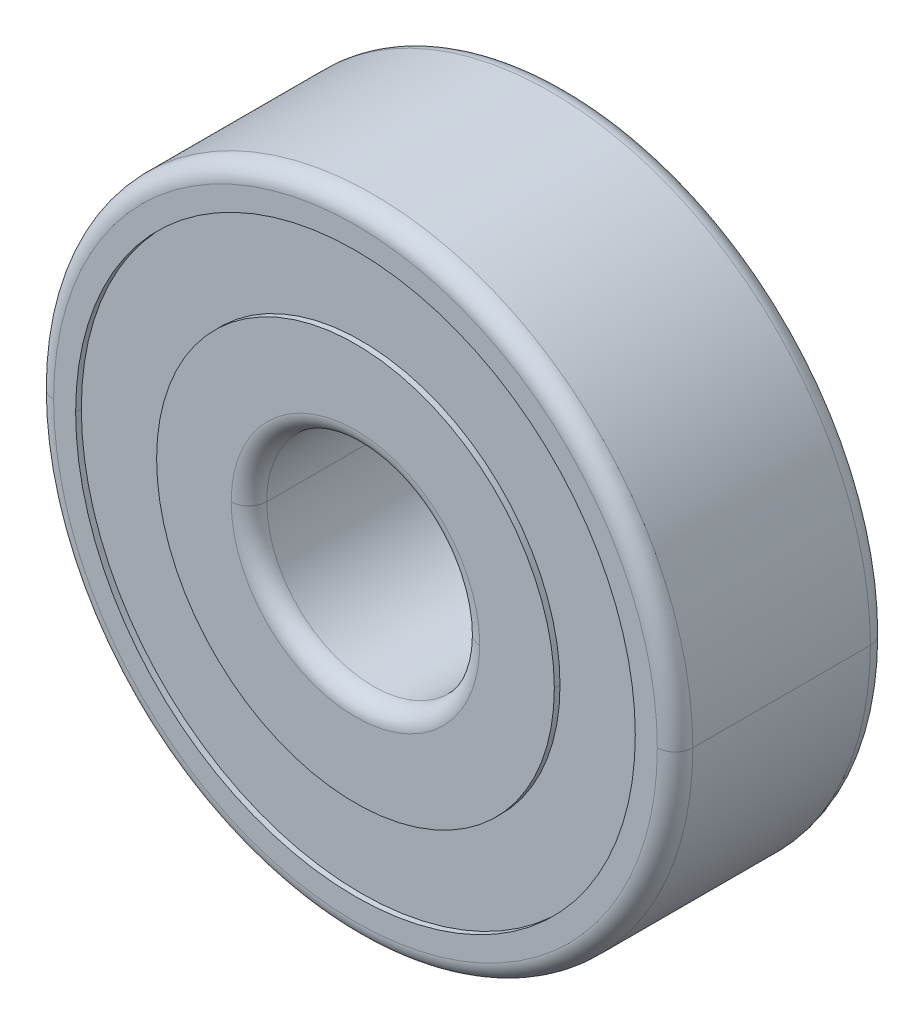
ISO-10303-21;
HEADER;
FILE_DESCRIPTION(('STEP AP214'),'2;1');
FILE_NAME('part.step','',(''),(''),'','','');
FILE_SCHEMA(('AUTOMOTIVE_DESIGN { 1 0 10303 214 1 1 1 1 }'));
ENDSEC;
DATA;
#1=APPLICATION_CONTEXT('core data for automotive mechanical design processes');
#2=APPLICATION_PROTOCOL_DEFINITION('international standard','automotive_design',2000,#1);
#3=PRODUCT_CONTEXT('',#1,'mechanical');
#4=PRODUCT('Part','Part','',(#3));
#5=PRODUCT_RELATED_PRODUCT_CATEGORY('part','',(#4));
#6=PRODUCT_DEFINITION_FORMATION('','',#4);
#7=PRODUCT_DEFINITION_CONTEXT('part definition',#1,'design');
#8=PRODUCT_DEFINITION('design','',#6,#7);
#9=PRODUCT_DEFINITION_SHAPE('','',#8);
#10=(LENGTH_UNIT() NAMED_UNIT(*) SI_UNIT(.MILLI.,.METRE.));
#11=(NAMED_UNIT(*) PLANE_ANGLE_UNIT() SI_UNIT($,.RADIAN.));
#12=(NAMED_UNIT(*) SI_UNIT($,.STERADIAN.) SOLID_ANGLE_UNIT());
#13=UNCERTAINTY_MEASURE_WITH_UNIT(LENGTH_MEASURE(1.E-05),#10,'distance_accuracy_value','');
#14=(GEOMETRIC_REPRESENTATION_CONTEXT(3) GLOBAL_UNCERTAINTY_ASSIGNED_CONTEXT((#13)) GLOBAL_UNIT_ASSIGNED_CONTEXT((#10,
#11,#12)) REPRESENTATION_CONTEXT('',''));
#15=CARTESIAN_POINT('',(0.,0.,0.));
#16=DIRECTION('',(0.,0.,1.));
#17=DIRECTION('',(1.,0.,0.));
#18=AXIS2_PLACEMENT_3D('',#15,#16,#17);
#19=CARTESIAN_POINT('',(0.,0.,-4.5085));
#20=DIRECTION('',(0.,0.,-1.));
#21=DIRECTION('',(-1.,0.,0.));
#22=AXIS2_PLACEMENT_3D('',#19,#20,#21);
#23=CYLINDRICAL_SURFACE('',#22,8.89);
#24=DIRECTION('',(0.,0.,-1.));
#25=VECTOR('',#24,1.);
#26=CARTESIAN_POINT('',(8.89,0.,-4.5085));
#27=LINE('',#26,#25);
#28=CARTESIAN_POINT('',(8.89,0.,-4.5085));
#29=VERTEX_POINT('',#28);
#30=CARTESIAN_POINT('',(8.89,0.,-4.7625));
#31=VERTEX_POINT('',#30);
#32=EDGE_CURVE('E387',#29,#31,#27,.T.);
#33=ORIENTED_EDGE('',*,*,#32,.F.);
#34=CARTESIAN_POINT('',(0.,0.,-4.5085));
#35=DIRECTION('',(0.,0.,1.));
#36=DIRECTION('',(1.,0.,0.));
#37=AXIS2_PLACEMENT_3D('',#34,#35,#36);
#38=CIRCLE('',#37,8.89);
#39=CARTESIAN_POINT('',(-8.89,0.,-4.5085));
#40=VERTEX_POINT('',#39);
#41=EDGE_CURVE('E11',#40,#29,#38,.T.);
#42=ORIENTED_EDGE('',*,*,#41,.F.);
#43=DIRECTION('',(0.,0.,-1.));
#44=VECTOR('',#43,1.);
#45=CARTESIAN_POINT('',(-8.89,0.,-4.5085));
#46=LINE('',#45,#44);
#47=CARTESIAN_POINT('',(-8.89,0.,-4.7625));
#48=VERTEX_POINT('',#47);
#49=EDGE_CURVE('E349',#40,#48,#46,.T.);
#50=ORIENTED_EDGE('',*,*,#49,.T.);
#51=CARTESIAN_POINT('',(0.,0.,-4.7625));
#52=DIRECTION('',(0.,0.,1.));
#53=DIRECTION('',(1.,0.,0.));
#54=AXIS2_PLACEMENT_3D('',#51,#52,#53);
#55=CIRCLE('',#54,8.89);
#56=EDGE_CURVE('E304',#48,#31,#55,.T.);
#57=ORIENTED_EDGE('',*,*,#56,.T.);
#58=EDGE_LOOP('',(#33,#42,#50,#57));
#59=FACE_BOUND('',#58,.T.);
#60=ADVANCED_FACE('F16',(#59),#23,.T.);
#61=CARTESIAN_POINT('',(0.,0.,-4.5085));
#62=DIRECTION('',(0.,0.,-1.));
#63=DIRECTION('',(-1.,0.,0.));
#64=AXIS2_PLACEMENT_3D('',#61,#62,#63);
#65=CYLINDRICAL_SURFACE('',#64,12.5095);
#66=DIRECTION('',(0.,0.,-1.));
#67=VECTOR('',#66,1.);
#68=CARTESIAN_POINT('',(12.5095,0.,-4.5085));
#69=LINE('',#68,#67);
#70=CARTESIAN_POINT('',(12.5095,0.,-4.5085));
#71=VERTEX_POINT('',#70);
#72=CARTESIAN_POINT('',(12.5095,0.,-4.7625));
#73=VERTEX_POINT('',#72);
#74=EDGE_CURVE('E339',#71,#73,#69,.T.);
#75=ORIENTED_EDGE('',*,*,#74,.F.);
#76=CARTESIAN_POINT('',(0.,0.,-4.5085));
#77=DIRECTION('',(0.,0.,1.));
#78=DIRECTION('',(1.,0.,0.));
#79=AXIS2_PLACEMENT_3D('',#76,#77,#78);
#80=CIRCLE('',#79,12.5095);
#81=CARTESIAN_POINT('',(-12.5095,0.,-4.5085));
#82=VERTEX_POINT('',#81);
#83=EDGE_CURVE('E25',#71,#82,#80,.T.);
#84=ORIENTED_EDGE('',*,*,#83,.T.);
#85=DIRECTION('',(0.,0.,-1.));
#86=VECTOR('',#85,1.);
#87=CARTESIAN_POINT('',(-12.5095,0.,-4.5085));
#88=LINE('',#87,#86);
#89=CARTESIAN_POINT('',(-12.5095,0.,-4.7625));
#90=VERTEX_POINT('',#89);
#91=EDGE_CURVE('E204',#82,#90,#88,.T.);
#92=ORIENTED_EDGE('',*,*,#91,.T.);
#93=CARTESIAN_POINT('',(0.,0.,-4.7625));
#94=DIRECTION('',(0.,0.,1.));
#95=DIRECTION('',(1.,0.,0.));
#96=AXIS2_PLACEMENT_3D('',#93,#94,#95);
#97=CIRCLE('',#96,12.5095);
#98=EDGE_CURVE('E177',#73,#90,#97,.T.);
#99=ORIENTED_EDGE('',*,*,#98,.F.);
#100=EDGE_LOOP('',(#75,#84,#92,#99));
#101=FACE_BOUND('',#100,.T.);
#102=ADVANCED_FACE('F334',(#101),#65,.F.);
#103=CARTESIAN_POINT('',(0.,0.,-4.5085));
#104=DIRECTION('',(0.,0.,-1.));
#105=DIRECTION('',(0.,-1.,0.));
#106=AXIS2_PLACEMENT_3D('',#103,#104,#105);
#107=PLANE('',#106);
#108=ORIENTED_EDGE('',*,*,#41,.T.);
#109=CARTESIAN_POINT('',(0.,0.,-4.5085));
#110=DIRECTION('',(0.,0.,1.));
#111=DIRECTION('',(1.,0.,0.));
#112=AXIS2_PLACEMENT_3D('',#109,#110,#111);
#113=CIRCLE('',#112,8.89);
#114=EDGE_CURVE('E383',#29,#40,#113,.T.);
#115=ORIENTED_EDGE('',*,*,#114,.T.);
#116=EDGE_LOOP('',(#108,#115));
#117=FACE_BOUND('',#116,.T.);
#118=CARTESIAN_POINT('',(0.,0.,-4.5085));
#119=DIRECTION('',(0.,0.,1.));
#120=DIRECTION('',(1.,0.,0.));
#121=AXIS2_PLACEMENT_3D('',#118,#119,#120);
#122=CIRCLE('',#121,12.5095);
#123=EDGE_CURVE('E344',#82,#71,#122,.T.);
#124=ORIENTED_EDGE('',*,*,#123,.F.);
#125=ORIENTED_EDGE('',*,*,#83,.F.);
#126=EDGE_LOOP('',(#124,#125));
#127=FACE_BOUND('',#126,.T.);
#128=ADVANCED_FACE('F431',(#117,#127),#107,.T.);
#129=CARTESIAN_POINT('',(0.,0.,4.5085));
#130=DIRECTION('',(0.,0.,1.));
#131=DIRECTION('',(1.,0.,0.));
#132=AXIS2_PLACEMENT_3D('',#129,#130,#131);
#133=CYLINDRICAL_SURFACE('',#132,8.89);
#134=DIRECTION('',(0.,0.,1.));
#135=VECTOR('',#134,1.);
#136=CARTESIAN_POINT('',(-8.89,0.,4.5085));
#137=LINE('',#136,#135);
#138=CARTESIAN_POINT('',(-8.89,0.,4.5085));
#139=VERTEX_POINT('',#138);
#140=CARTESIAN_POINT('',(-8.89,0.,4.7625));
#141=VERTEX_POINT('',#140);
#142=EDGE_CURVE('E217',#139,#141,#137,.T.);
#143=ORIENTED_EDGE('',*,*,#142,.F.);
#144=CARTESIAN_POINT('',(0.,0.,4.5085));
#145=DIRECTION('',(0.,0.,1.));
#146=DIRECTION('',(1.,0.,0.));
#147=AXIS2_PLACEMENT_3D('',#144,#145,#146);
#148=CIRCLE('',#147,8.89);
#149=CARTESIAN_POINT('',(8.89,0.,4.5085));
#150=VERTEX_POINT('',#149);
#151=EDGE_CURVE('E19',#139,#150,#148,.T.);
#152=ORIENTED_EDGE('',*,*,#151,.T.);
#153=DIRECTION('',(0.,0.,1.));
#154=VECTOR('',#153,1.);
#155=CARTESIAN_POINT('',(8.89,0.,4.5085));
#156=LINE('',#155,#154);
#157=CARTESIAN_POINT('',(8.89,0.,4.7625));
#158=VERTEX_POINT('',#157);
#159=EDGE_CURVE('E191',#150,#158,#156,.T.);
#160=ORIENTED_EDGE('',*,*,#159,.T.);
#161=CARTESIAN_POINT('',(0.,0.,4.7625));
#162=DIRECTION('',(0.,0.,1.));
#163=DIRECTION('',(1.,0.,0.));
#164=AXIS2_PLACEMENT_3D('',#161,#162,#163);
#165=CIRCLE('',#164,8.89);
#166=EDGE_CURVE('E309',#141,#158,#165,.T.);
#167=ORIENTED_EDGE('',*,*,#166,.F.);
#168=EDGE_LOOP('',(#143,#152,#160,#167));
#169=FACE_BOUND('',#168,.T.);
#170=ADVANCED_FACE('F436',(#169),#133,.T.);
#171=CARTESIAN_POINT('',(0.,0.,4.5085));
#172=DIRECTION('',(0.,0.,1.));
#173=DIRECTION('',(1.,0.,0.));
#174=AXIS2_PLACEMENT_3D('',#171,#172,#173);
#175=PLANE('',#174);
#176=CARTESIAN_POINT('',(0.,0.,4.5085));
#177=DIRECTION('',(0.,0.,1.));
#178=DIRECTION('',(1.,0.,0.));
#179=AXIS2_PLACEMENT_3D('',#176,#177,#178);
#180=CIRCLE('',#179,8.89);
#181=EDGE_CURVE('E208',#150,#139,#180,.T.);
#182=ORIENTED_EDGE('',*,*,#181,.F.);
#183=ORIENTED_EDGE('',*,*,#151,.F.);
#184=EDGE_LOOP('',(#182,#183));
#185=FACE_BOUND('',#184,.T.);
#186=CARTESIAN_POINT('',(0.,0.,4.5085));
#187=DIRECTION('',(0.,0.,1.));
#188=DIRECTION('',(1.,0.,0.));
#189=AXIS2_PLACEMENT_3D('',#186,#187,#188);
#190=CIRCLE('',#189,12.5095);
#191=CARTESIAN_POINT('',(12.5095,0.,4.5085));
#192=VERTEX_POINT('',#191);
#193=CARTESIAN_POINT('',(-12.5095,0.,4.5085));
#194=VERTEX_POINT('',#193);
#195=EDGE_CURVE('E168',#192,#194,#190,.T.);
#196=ORIENTED_EDGE('',*,*,#195,.T.);
#197=CARTESIAN_POINT('',(0.,0.,4.5085));
#198=DIRECTION('',(0.,0.,1.));
#199=DIRECTION('',(1.,0.,0.));
#200=AXIS2_PLACEMENT_3D('',#197,#198,#199);
#201=CIRCLE('',#200,12.5095);
#202=EDGE_CURVE('E172',#194,#192,#201,.T.);
#203=ORIENTED_EDGE('',*,*,#202,.T.);
#204=EDGE_LOOP('',(#196,#203));
#205=FACE_BOUND('',#204,.T.);
#206=ADVANCED_FACE('F170',(#185,#205),#175,.T.);
#207=CARTESIAN_POINT('',(0.,0.,4.5085));
#208=DIRECTION('',(0.,0.,1.));
#209=DIRECTION('',(1.,0.,0.));
#210=AXIS2_PLACEMENT_3D('',#207,#208,#209);
#211=CYLINDRICAL_SURFACE('',#210,12.5095);
#212=DIRECTION('',(0.,0.,1.));
#213=VECTOR('',#212,1.);
#214=CARTESIAN_POINT('',(-12.5095,0.,4.5085));
#215=LINE('',#214,#213);
#216=CARTESIAN_POINT('',(-12.5095,0.,4.7625));
#217=VERTEX_POINT('',#216);
#218=EDGE_CURVE('E179',#194,#217,#215,.T.);
#219=ORIENTED_EDGE('',*,*,#218,.F.);
#220=ORIENTED_EDGE('',*,*,#195,.F.);
#221=DIRECTION('',(0.,0.,1.));
#222=VECTOR('',#221,1.);
#223=CARTESIAN_POINT('',(12.5095,0.,4.5085));
#224=LINE('',#223,#222);
#225=CARTESIAN_POINT('',(12.5095,0.,4.7625));
#226=VERTEX_POINT('',#225);
#227=EDGE_CURVE('E189',#192,#226,#224,.T.);
#228=ORIENTED_EDGE('',*,*,#227,.T.);
#229=CARTESIAN_POINT('',(0.,0.,4.7625));
#230=DIRECTION('',(0.,0.,1.));
#231=DIRECTION('',(1.,0.,0.));
#232=AXIS2_PLACEMENT_3D('',#229,#230,#231);
#233=CIRCLE('',#232,12.5095);
#234=EDGE_CURVE('E181',#226,#217,#233,.T.);
#235=ORIENTED_EDGE('',*,*,#234,.T.);
#236=EDGE_LOOP('',(#219,#220,#228,#235));
#237=FACE_BOUND('',#236,.T.);
#238=ADVANCED_FACE('F180',(#237),#211,.F.);
#239=CARTESIAN_POINT('',(0.,0.,-4.7625));
#240=DIRECTION('',(0.,0.,1.));
#241=DIRECTION('',(1.,0.,0.));
#242=AXIS2_PLACEMENT_3D('',#239,#240,#241);
#243=PLANE('',#242);
#244=CARTESIAN_POINT('',(0.,0.,-4.7625));
#245=DIRECTION('',(0.,0.,1.));
#246=DIRECTION('',(1.,0.,0.));
#247=AXIS2_PLACEMENT_3D('',#244,#245,#246);
#248=CIRCLE('',#247,12.5095);
#249=EDGE_CURVE('E202',#90,#73,#248,.T.);
#250=ORIENTED_EDGE('',*,*,#249,.T.);
#251=ORIENTED_EDGE('',*,*,#98,.T.);
#252=EDGE_LOOP('',(#250,#251));
#253=FACE_BOUND('',#252,.T.);
#254=CARTESIAN_POINT('',(0.,0.,-4.7625));
#255=DIRECTION('',(0.,0.,-1.));
#256=DIRECTION('',(-1.,0.,0.));
#257=AXIS2_PLACEMENT_3D('',#254,#255,#256);
#258=CIRCLE('',#257,13.49375);
#259=CARTESIAN_POINT('',(-13.49375,0.,-4.7625));
#260=VERTEX_POINT('',#259);
#261=CARTESIAN_POINT('',(13.49375,0.,-4.7625));
#262=VERTEX_POINT('',#261);
#263=EDGE_CURVE('E224',#260,#262,#258,.T.);
#264=ORIENTED_EDGE('',*,*,#263,.T.);
#265=CARTESIAN_POINT('',(0.,0.,-4.7625));
#266=DIRECTION('',(0.,0.,-1.));
#267=DIRECTION('',(-1.,0.,0.));
#268=AXIS2_PLACEMENT_3D('',#265,#266,#267);
#269=CIRCLE('',#268,13.49375);
#270=EDGE_CURVE('E227',#262,#260,#269,.T.);
#271=ORIENTED_EDGE('',*,*,#270,.T.);
#272=EDGE_LOOP('',(#264,#271));
#273=FACE_BOUND('',#272,.T.);
#274=ADVANCED_FACE('F327',(#253,#273),#243,.F.);
#275=CARTESIAN_POINT('',(0.,0.,-3.96875));
#276=DIRECTION('',(0.,0.,1.));
#277=DIRECTION('',(-1.,0.,0.));
#278=AXIS2_PLACEMENT_3D('',#275,#276,#277);
#279=TOROIDAL_SURFACE('',#278,13.49375,0.79375);
#280=CARTESIAN_POINT('',(13.49375,0.,-3.96875));
#281=DIRECTION('',(0.,-1.,0.));
#282=DIRECTION('',(1.,0.,0.));
#283=AXIS2_PLACEMENT_3D('',#280,#281,#282);
#284=CIRCLE('',#283,0.79375);
#285=CARTESIAN_POINT('',(14.2875,0.,-3.96875));
#286=VERTEX_POINT('',#285);
#287=EDGE_CURVE('E230',#262,#286,#284,.T.);
#288=ORIENTED_EDGE('',*,*,#287,.F.);
#289=ORIENTED_EDGE('',*,*,#263,.F.);
#290=CARTESIAN_POINT('',(-13.49375,0.,-3.96875));
#291=DIRECTION('',(0.,1.,0.));
#292=DIRECTION('',(0.,0.,1.));
#293=AXIS2_PLACEMENT_3D('',#290,#291,#292);
#294=CIRCLE('',#293,0.79375);
#295=CARTESIAN_POINT('',(-14.2875,0.,-3.96875));
#296=VERTEX_POINT('',#295);
#297=EDGE_CURVE('E243',#260,#296,#294,.T.);
#298=ORIENTED_EDGE('',*,*,#297,.T.);
#299=CARTESIAN_POINT('',(0.,0.,-3.96875));
#300=DIRECTION('',(0.,0.,1.));
#301=DIRECTION('',(-1.,0.,0.));
#302=AXIS2_PLACEMENT_3D('',#299,#300,#301);
#303=CIRCLE('',#302,14.2875);
#304=EDGE_CURVE('E255',#286,#296,#303,.T.);
#305=ORIENTED_EDGE('',*,*,#304,.F.);
#306=EDGE_LOOP('',(#288,#289,#298,#305));
#307=FACE_BOUND('',#306,.T.);
#308=ADVANCED_FACE('F365',(#307),#279,.T.);
#309=CARTESIAN_POINT('',(0.,0.,4.7625));
#310=DIRECTION('',(0.,0.,1.));
#311=DIRECTION('',(1.,0.,0.));
#312=AXIS2_PLACEMENT_3D('',#309,#310,#311);
#313=PLANE('',#312);
#314=ORIENTED_EDGE('',*,*,#234,.F.);
#315=CARTESIAN_POINT('',(0.,0.,4.7625));
#316=DIRECTION('',(0.,0.,1.));
#317=DIRECTION('',(1.,0.,0.));
#318=AXIS2_PLACEMENT_3D('',#315,#316,#317);
#319=CIRCLE('',#318,12.5095);
#320=EDGE_CURVE('E186',#217,#226,#319,.T.);
#321=ORIENTED_EDGE('',*,*,#320,.F.);
#322=EDGE_LOOP('',(#314,#321));
#323=FACE_BOUND('',#322,.T.);
#324=CARTESIAN_POINT('',(0.,0.,4.7625));
#325=DIRECTION('',(0.,0.,1.));
#326=DIRECTION('',(-1.,0.,0.));
#327=AXIS2_PLACEMENT_3D('',#324,#325,#326);
#328=CIRCLE('',#327,13.49375);
#329=CARTESIAN_POINT('',(13.49375,0.,4.7625));
#330=VERTEX_POINT('',#329);
#331=CARTESIAN_POINT('',(-13.49375,0.,4.7625));
#332=VERTEX_POINT('',#331);
#333=EDGE_CURVE('E282',#330,#332,#328,.T.);
#334=ORIENTED_EDGE('',*,*,#333,.T.);
#335=CARTESIAN_POINT('',(0.,0.,4.7625));
#336=DIRECTION('',(0.,0.,1.));
#337=DIRECTION('',(-1.,0.,0.));
#338=AXIS2_PLACEMENT_3D('',#335,#336,#337);
#339=CIRCLE('',#338,13.49375);
#340=EDGE_CURVE('E262',#332,#330,#339,.T.);
#341=ORIENTED_EDGE('',*,*,#340,.T.);
#342=EDGE_LOOP('',(#334,#341));
#343=FACE_BOUND('',#342,.T.);
#344=ADVANCED_FACE('F361',(#323,#343),#313,.T.);
#345=CARTESIAN_POINT('',(0.,0.,0.));
#346=DIRECTION('',(0.,0.,-1.));
#347=DIRECTION('',(-1.,0.,0.));
#348=AXIS2_PLACEMENT_3D('',#345,#346,#347);
#349=CYLINDRICAL_SURFACE('',#348,14.2875);
#350=DIRECTION('',(0.,0.,-1.));
#351=VECTOR('',#350,1.);
#352=CARTESIAN_POINT('',(14.2875,0.,0.));
#353=LINE('',#352,#351);
#354=CARTESIAN_POINT('',(14.2875,0.,3.96875));
#355=VERTEX_POINT('',#354);
#356=EDGE_CURVE('E251',#355,#286,#353,.T.);
#357=ORIENTED_EDGE('',*,*,#356,.F.);
#358=CARTESIAN_POINT('',(0.,0.,3.96875));
#359=DIRECTION('',(0.,0.,-1.));
#360=DIRECTION('',(-1.,0.,0.));
#361=AXIS2_PLACEMENT_3D('',#358,#359,#360);
#362=CIRCLE('',#361,14.2875);
#363=CARTESIAN_POINT('',(-14.2875,0.,3.96875));
#364=VERTEX_POINT('',#363);
#365=EDGE_CURVE('E213',#355,#364,#362,.T.);
#366=ORIENTED_EDGE('',*,*,#365,.T.);
#367=DIRECTION('',(0.,0.,-1.));
#368=VECTOR('',#367,1.);
#369=CARTESIAN_POINT('',(-14.2875,0.,0.));
#370=LINE('',#369,#368);
#371=EDGE_CURVE('E259',#364,#296,#370,.T.);
#372=ORIENTED_EDGE('',*,*,#371,.T.);
#373=CARTESIAN_POINT('',(0.,0.,-3.96875));
#374=DIRECTION('',(0.,0.,1.));
#375=DIRECTION('',(-1.,0.,0.));
#376=AXIS2_PLACEMENT_3D('',#373,#374,#375);
#377=CIRCLE('',#376,14.2875);
#378=EDGE_CURVE('E235',#296,#286,#377,.T.);
#379=ORIENTED_EDGE('',*,*,#378,.T.);
#380=EDGE_LOOP('',(#357,#366,#372,#379));
#381=FACE_BOUND('',#380,.T.);
#382=ADVANCED_FACE('F364',(#381),#349,.T.);
#383=CARTESIAN_POINT('',(0.,0.,3.96875));
#384=DIRECTION('',(0.,0.,-1.));
#385=DIRECTION('',(1.,0.,0.));
#386=AXIS2_PLACEMENT_3D('',#383,#384,#385);
#387=TOROIDAL_SURFACE('',#386,13.49375,0.79375);
#388=CARTESIAN_POINT('',(-13.49375,0.,3.96875));
#389=DIRECTION('',(0.,-1.,0.));
#390=DIRECTION('',(1.,0.,0.));
#391=AXIS2_PLACEMENT_3D('',#388,#389,#390);
#392=CIRCLE('',#391,0.79375);
#393=EDGE_CURVE('E263',#332,#364,#392,.T.);
#394=ORIENTED_EDGE('',*,*,#393,.F.);
#395=ORIENTED_EDGE('',*,*,#333,.F.);
#396=CARTESIAN_POINT('',(13.49375,0.,3.96875));
#397=DIRECTION('',(0.,1.,0.));
#398=DIRECTION('',(0.,0.,1.));
#399=AXIS2_PLACEMENT_3D('',#396,#397,#398);
#400=CIRCLE('',#399,0.79375);
#401=EDGE_CURVE('E209',#330,#355,#400,.T.);
#402=ORIENTED_EDGE('',*,*,#401,.T.);
#403=CARTESIAN_POINT('',(0.,0.,3.96875));
#404=DIRECTION('',(0.,0.,-1.));
#405=DIRECTION('',(-1.,0.,0.));
#406=AXIS2_PLACEMENT_3D('',#403,#404,#405);
#407=CIRCLE('',#406,14.2875);
#408=EDGE_CURVE('E247',#364,#355,#407,.T.);
#409=ORIENTED_EDGE('',*,*,#408,.F.);
#410=EDGE_LOOP('',(#394,#395,#402,#409));
#411=FACE_BOUND('',#410,.T.);
#412=ADVANCED_FACE('F373',(#411),#387,.T.);
#413=CARTESIAN_POINT('',(0.,0.,3.96875));
#414=DIRECTION('',(0.,0.,1.));
#415=DIRECTION('',(-1.,0.,0.));
#416=AXIS2_PLACEMENT_3D('',#413,#414,#415);
#417=TOROIDAL_SURFACE('',#416,5.55625,0.79375);
#418=CARTESIAN_POINT('',(5.55625,0.,3.96875));
#419=DIRECTION('',(0.,-1.,0.));
#420=DIRECTION('',(1.,0.,0.));
#421=AXIS2_PLACEMENT_3D('',#418,#419,#420);
#422=CIRCLE('',#421,0.79375);
#423=CARTESIAN_POINT('',(5.55625,0.,4.7625));
#424=VERTEX_POINT('',#423);
#425=CARTESIAN_POINT('',(4.7625,0.,3.96875));
#426=VERTEX_POINT('',#425);
#427=EDGE_CURVE('E239',#424,#426,#422,.T.);
#428=ORIENTED_EDGE('',*,*,#427,.F.);
#429=CARTESIAN_POINT('',(0.,0.,4.7625));
#430=DIRECTION('',(0.,0.,1.));
#431=DIRECTION('',(-1.,0.,0.));
#432=AXIS2_PLACEMENT_3D('',#429,#430,#431);
#433=CIRCLE('',#432,5.55625);
#434=CARTESIAN_POINT('',(-5.55625,0.,4.7625));
#435=VERTEX_POINT('',#434);
#436=EDGE_CURVE('E312',#424,#435,#433,.T.);
#437=ORIENTED_EDGE('',*,*,#436,.T.);
#438=CARTESIAN_POINT('',(-5.55625,0.,3.96875));
#439=DIRECTION('',(0.,1.,0.));
#440=DIRECTION('',(0.,0.,1.));
#441=AXIS2_PLACEMENT_3D('',#438,#439,#440);
#442=CIRCLE('',#441,0.79375);
#443=CARTESIAN_POINT('',(-4.7625,0.,3.96875));
#444=VERTEX_POINT('',#443);
#445=EDGE_CURVE('E273',#435,#444,#442,.T.);
#446=ORIENTED_EDGE('',*,*,#445,.T.);
#447=CARTESIAN_POINT('',(0.,0.,3.96875));
#448=DIRECTION('',(0.,0.,-1.));
#449=DIRECTION('',(-1.,0.,0.));
#450=AXIS2_PLACEMENT_3D('',#447,#448,#449);
#451=CIRCLE('',#450,4.7625);
#452=EDGE_CURVE('E285',#444,#426,#451,.T.);
#453=ORIENTED_EDGE('',*,*,#452,.T.);
#454=EDGE_LOOP('',(#428,#437,#446,#453));
#455=FACE_BOUND('',#454,.T.);
#456=ADVANCED_FACE('F456',(#455),#417,.T.);
#457=CARTESIAN_POINT('',(0.,0.,0.));
#458=DIRECTION('',(0.,0.,-1.));
#459=DIRECTION('',(-1.,0.,0.));
#460=AXIS2_PLACEMENT_3D('',#457,#458,#459);
#461=CYLINDRICAL_SURFACE('',#460,4.7625);
#462=DIRECTION('',(0.,0.,-1.));
#463=VECTOR('',#462,1.);
#464=CARTESIAN_POINT('',(4.7625,0.,0.));
#465=LINE('',#464,#463);
#466=CARTESIAN_POINT('',(4.7625,0.,-3.96875));
#467=VERTEX_POINT('',#466);
#468=EDGE_CURVE('E277',#426,#467,#465,.T.);
#469=ORIENTED_EDGE('',*,*,#468,.F.);
#470=ORIENTED_EDGE('',*,*,#452,.F.);
#471=DIRECTION('',(0.,0.,-1.));
#472=VECTOR('',#471,1.);
#473=CARTESIAN_POINT('',(-4.7625,0.,0.));
#474=LINE('',#473,#472);
#475=CARTESIAN_POINT('',(-4.7625,0.,-3.96875));
#476=VERTEX_POINT('',#475);
#477=EDGE_CURVE('E289',#444,#476,#474,.T.);
#478=ORIENTED_EDGE('',*,*,#477,.T.);
#479=CARTESIAN_POINT('',(0.,0.,-3.96875));
#480=DIRECTION('',(0.,0.,1.));
#481=DIRECTION('',(-1.,0.,0.));
#482=AXIS2_PLACEMENT_3D('',#479,#480,#481);
#483=CIRCLE('',#482,4.7625);
#484=EDGE_CURVE('E315',#467,#476,#483,.T.);
#485=ORIENTED_EDGE('',*,*,#484,.F.);
#486=EDGE_LOOP('',(#469,#470,#478,#485));
#487=FACE_BOUND('',#486,.T.);
#488=ADVANCED_FACE('F459',(#487),#461,.F.);
#489=CARTESIAN_POINT('',(0.,0.,-3.96875));
#490=DIRECTION('',(0.,0.,1.));
#491=DIRECTION('',(-1.,0.,0.));
#492=AXIS2_PLACEMENT_3D('',#489,#490,#491);
#493=TOROIDAL_SURFACE('',#492,5.55625,0.79375);
#494=CARTESIAN_POINT('',(5.55625,0.,-3.96875));
#495=DIRECTION('',(0.,-1.,0.));
#496=DIRECTION('',(1.,0.,0.));
#497=AXIS2_PLACEMENT_3D('',#494,#495,#496);
#498=CIRCLE('',#497,0.79375);
#499=CARTESIAN_POINT('',(5.55625,0.,-4.7625));
#500=VERTEX_POINT('',#499);
#501=EDGE_CURVE('E293',#467,#500,#498,.T.);
#502=ORIENTED_EDGE('',*,*,#501,.F.);
#503=ORIENTED_EDGE('',*,*,#484,.T.);
#504=CARTESIAN_POINT('',(-5.55625,0.,-3.96875));
#505=DIRECTION('',(0.,1.,0.));
#506=DIRECTION('',(0.,0.,1.));
#507=AXIS2_PLACEMENT_3D('',#504,#505,#506);
#508=CIRCLE('',#507,0.79375);
#509=CARTESIAN_POINT('',(-5.55625,0.,-4.7625));
#510=VERTEX_POINT('',#509);
#511=EDGE_CURVE('E301',#476,#510,#508,.T.);
#512=ORIENTED_EDGE('',*,*,#511,.T.);
#513=CARTESIAN_POINT('',(0.,0.,-4.7625));
#514=DIRECTION('',(0.,0.,-1.));
#515=DIRECTION('',(-1.,0.,0.));
#516=AXIS2_PLACEMENT_3D('',#513,#514,#515);
#517=CIRCLE('',#516,5.55625);
#518=EDGE_CURVE('E38',#510,#500,#517,.T.);
#519=ORIENTED_EDGE('',*,*,#518,.T.);
#520=EDGE_LOOP('',(#502,#503,#512,#519));
#521=FACE_BOUND('',#520,.T.);
#522=ADVANCED_FACE('F421',(#521),#493,.T.);
#523=CARTESIAN_POINT('',(0.,0.,4.7625));
#524=DIRECTION('',(0.,0.,1.));
#525=DIRECTION('',(1.,0.,0.));
#526=AXIS2_PLACEMENT_3D('',#523,#524,#525);
#527=PLANE('',#526);
#528=CARTESIAN_POINT('',(0.,0.,4.7625));
#529=DIRECTION('',(0.,0.,1.));
#530=DIRECTION('',(-1.,0.,0.));
#531=AXIS2_PLACEMENT_3D('',#528,#529,#530);
#532=CIRCLE('',#531,5.55625);
#533=EDGE_CURVE('E212',#435,#424,#532,.T.);
#534=ORIENTED_EDGE('',*,*,#533,.F.);
#535=ORIENTED_EDGE('',*,*,#436,.F.);
#536=EDGE_LOOP('',(#534,#535));
#537=FACE_BOUND('',#536,.T.);
#538=CARTESIAN_POINT('',(0.,0.,4.7625));
#539=DIRECTION('',(0.,0.,1.));
#540=DIRECTION('',(1.,0.,0.));
#541=AXIS2_PLACEMENT_3D('',#538,#539,#540);
#542=CIRCLE('',#541,8.89);
#543=EDGE_CURVE('E198',#158,#141,#542,.T.);
#544=ORIENTED_EDGE('',*,*,#543,.T.);
#545=ORIENTED_EDGE('',*,*,#166,.T.);
#546=EDGE_LOOP('',(#544,#545));
#547=FACE_BOUND('',#546,.T.);
#548=ADVANCED_FACE('F410',(#537,#547),#527,.T.);
#549=CARTESIAN_POINT('',(0.,0.,-4.7625));
#550=DIRECTION('',(0.,0.,1.));
#551=DIRECTION('',(1.,0.,0.));
#552=AXIS2_PLACEMENT_3D('',#549,#550,#551);
#553=PLANE('',#552);
#554=ORIENTED_EDGE('',*,*,#518,.F.);
#555=CARTESIAN_POINT('',(0.,0.,-4.7625));
#556=DIRECTION('',(0.,0.,-1.));
#557=DIRECTION('',(-1.,0.,0.));
#558=AXIS2_PLACEMENT_3D('',#555,#556,#557);
#559=CIRCLE('',#558,5.55625);
#560=EDGE_CURVE('E297',#500,#510,#559,.T.);
#561=ORIENTED_EDGE('',*,*,#560,.F.);
#562=EDGE_LOOP('',(#554,#561));
#563=FACE_BOUND('',#562,.T.);
#564=ORIENTED_EDGE('',*,*,#56,.F.);
#565=CARTESIAN_POINT('',(0.,0.,-4.7625));
#566=DIRECTION('',(0.,0.,1.));
#567=DIRECTION('',(1.,0.,0.));
#568=AXIS2_PLACEMENT_3D('',#565,#566,#567);
#569=CIRCLE('',#568,8.89);
#570=EDGE_CURVE('E388',#31,#48,#569,.T.);
#571=ORIENTED_EDGE('',*,*,#570,.F.);
#572=EDGE_LOOP('',(#564,#571));
#573=FACE_BOUND('',#572,.T.);
#574=ADVANCED_FACE('F407',(#563,#573),#553,.F.);
#575=CARTESIAN_POINT('',(0.,0.,-3.96875));
#576=DIRECTION('',(0.,0.,1.));
#577=DIRECTION('',(-1.,0.,0.));
#578=AXIS2_PLACEMENT_3D('',#575,#576,#577);
#579=TOROIDAL_SURFACE('',#578,5.55625,0.79375);
#580=CARTESIAN_POINT('',(0.,0.,-3.96875));
#581=DIRECTION('',(0.,0.,1.));
#582=DIRECTION('',(-1.,0.,0.));
#583=AXIS2_PLACEMENT_3D('',#580,#581,#582);
#584=CIRCLE('',#583,4.7625);
#585=EDGE_CURVE('E281',#476,#467,#584,.T.);
#586=ORIENTED_EDGE('',*,*,#585,.T.);
#587=ORIENTED_EDGE('',*,*,#501,.T.);
#588=ORIENTED_EDGE('',*,*,#560,.T.);
#589=ORIENTED_EDGE('',*,*,#511,.F.);
#590=EDGE_LOOP('',(#586,#587,#588,#589));
#591=FACE_BOUND('',#590,.T.);
#592=ADVANCED_FACE('F409',(#591),#579,.T.);
#593=CARTESIAN_POINT('',(0.,0.,0.));
#594=DIRECTION('',(0.,0.,-1.));
#595=DIRECTION('',(-1.,0.,0.));
#596=AXIS2_PLACEMENT_3D('',#593,#594,#595);
#597=CYLINDRICAL_SURFACE('',#596,4.7625);
#598=CARTESIAN_POINT('',(0.,0.,3.96875));
#599=DIRECTION('',(0.,0.,-1.));
#600=DIRECTION('',(-1.,0.,0.));
#601=AXIS2_PLACEMENT_3D('',#598,#599,#600);
#602=CIRCLE('',#601,4.7625);
#603=EDGE_CURVE('E272',#426,#444,#602,.T.);
#604=ORIENTED_EDGE('',*,*,#603,.F.);
#605=ORIENTED_EDGE('',*,*,#468,.T.);
#606=ORIENTED_EDGE('',*,*,#585,.F.);
#607=ORIENTED_EDGE('',*,*,#477,.F.);
#608=EDGE_LOOP('',(#604,#605,#606,#607));
#609=FACE_BOUND('',#608,.T.);
#610=ADVANCED_FACE('F418',(#609),#597,.F.);
#611=CARTESIAN_POINT('',(0.,0.,3.96875));
#612=DIRECTION('',(0.,0.,1.));
#613=DIRECTION('',(-1.,0.,0.));
#614=AXIS2_PLACEMENT_3D('',#611,#612,#613);
#615=TOROIDAL_SURFACE('',#614,5.55625,0.79375);
#616=ORIENTED_EDGE('',*,*,#533,.T.);
#617=ORIENTED_EDGE('',*,*,#427,.T.);
#618=ORIENTED_EDGE('',*,*,#603,.T.);
#619=ORIENTED_EDGE('',*,*,#445,.F.);
#620=EDGE_LOOP('',(#616,#617,#618,#619));
#621=FACE_BOUND('',#620,.T.);
#622=ADVANCED_FACE('F468',(#621),#615,.T.);
#623=CARTESIAN_POINT('',(0.,0.,3.96875));
#624=DIRECTION('',(0.,0.,-1.));
#625=DIRECTION('',(1.,0.,0.));
#626=AXIS2_PLACEMENT_3D('',#623,#624,#625);
#627=TOROIDAL_SURFACE('',#626,13.49375,0.79375);
#628=ORIENTED_EDGE('',*,*,#340,.F.);
#629=ORIENTED_EDGE('',*,*,#393,.T.);
#630=ORIENTED_EDGE('',*,*,#365,.F.);
#631=ORIENTED_EDGE('',*,*,#401,.F.);
#632=EDGE_LOOP('',(#628,#629,#630,#631));
#633=FACE_BOUND('',#632,.T.);
#634=ADVANCED_FACE('F377',(#633),#627,.T.);
#635=CARTESIAN_POINT('',(0.,0.,0.));
#636=DIRECTION('',(0.,0.,-1.));
#637=DIRECTION('',(-1.,0.,0.));
#638=AXIS2_PLACEMENT_3D('',#635,#636,#637);
#639=CYLINDRICAL_SURFACE('',#638,14.2875);
#640=ORIENTED_EDGE('',*,*,#408,.T.);
#641=ORIENTED_EDGE('',*,*,#356,.T.);
#642=ORIENTED_EDGE('',*,*,#304,.T.);
#643=ORIENTED_EDGE('',*,*,#371,.F.);
#644=EDGE_LOOP('',(#640,#641,#642,#643));
#645=FACE_BOUND('',#644,.T.);
#646=ADVANCED_FACE('F467',(#645),#639,.T.);
#647=CARTESIAN_POINT('',(0.,0.,-3.96875));
#648=DIRECTION('',(0.,0.,1.));
#649=DIRECTION('',(-1.,0.,0.));
#650=AXIS2_PLACEMENT_3D('',#647,#648,#649);
#651=TOROIDAL_SURFACE('',#650,13.49375,0.79375);
#652=ORIENTED_EDGE('',*,*,#270,.F.);
#653=ORIENTED_EDGE('',*,*,#287,.T.);
#654=ORIENTED_EDGE('',*,*,#378,.F.);
#655=ORIENTED_EDGE('',*,*,#297,.F.);
#656=EDGE_LOOP('',(#652,#653,#654,#655));
#657=FACE_BOUND('',#656,.T.);
#658=ADVANCED_FACE('F475',(#657),#651,.T.);
#659=CARTESIAN_POINT('',(0.,0.,4.5085));
#660=DIRECTION('',(0.,0.,1.));
#661=DIRECTION('',(1.,0.,0.));
#662=AXIS2_PLACEMENT_3D('',#659,#660,#661);
#663=CYLINDRICAL_SURFACE('',#662,12.5095);
#664=ORIENTED_EDGE('',*,*,#202,.F.);
#665=ORIENTED_EDGE('',*,*,#218,.T.);
#666=ORIENTED_EDGE('',*,*,#320,.T.);
#667=ORIENTED_EDGE('',*,*,#227,.F.);
#668=EDGE_LOOP('',(#664,#665,#666,#667));
#669=FACE_BOUND('',#668,.T.);
#670=ADVANCED_FACE('F188',(#669),#663,.F.);
#671=CARTESIAN_POINT('',(0.,0.,4.5085));
#672=DIRECTION('',(0.,0.,1.));
#673=DIRECTION('',(1.,0.,0.));
#674=AXIS2_PLACEMENT_3D('',#671,#672,#673);
#675=CYLINDRICAL_SURFACE('',#674,8.89);
#676=ORIENTED_EDGE('',*,*,#181,.T.);
#677=ORIENTED_EDGE('',*,*,#142,.T.);
#678=ORIENTED_EDGE('',*,*,#543,.F.);
#679=ORIENTED_EDGE('',*,*,#159,.F.);
#680=EDGE_LOOP('',(#676,#677,#678,#679));
#681=FACE_BOUND('',#680,.T.);
#682=ADVANCED_FACE('F487',(#681),#675,.T.);
#683=CARTESIAN_POINT('',(0.,0.,-4.5085));
#684=DIRECTION('',(0.,0.,-1.));
#685=DIRECTION('',(-1.,0.,0.));
#686=AXIS2_PLACEMENT_3D('',#683,#684,#685);
#687=CYLINDRICAL_SURFACE('',#686,12.5095);
#688=ORIENTED_EDGE('',*,*,#123,.T.);
#689=ORIENTED_EDGE('',*,*,#74,.T.);
#690=ORIENTED_EDGE('',*,*,#249,.F.);
#691=ORIENTED_EDGE('',*,*,#91,.F.);
#692=EDGE_LOOP('',(#688,#689,#690,#691));
#693=FACE_BOUND('',#692,.T.);
#694=ADVANCED_FACE('F338',(#693),#687,.F.);
#695=CARTESIAN_POINT('',(0.,0.,-4.5085));
#696=DIRECTION('',(0.,0.,-1.));
#697=DIRECTION('',(-1.,0.,0.));
#698=AXIS2_PLACEMENT_3D('',#695,#696,#697);
#699=CYLINDRICAL_SURFACE('',#698,8.89);
#700=ORIENTED_EDGE('',*,*,#114,.F.);
#701=ORIENTED_EDGE('',*,*,#32,.T.);
#702=ORIENTED_EDGE('',*,*,#570,.T.);
#703=ORIENTED_EDGE('',*,*,#49,.F.);
#704=EDGE_LOOP('',(#700,#701,#702,#703));
#705=FACE_BOUND('',#704,.T.);
#706=ADVANCED_FACE('F401',(#705),#699,.T.);
#707=CLOSED_SHELL('',(#60,#102,#128,#170,#206,#238,#274,#308,#344,#382,#412,#456,#488,#522,#548,
#574,#592,#610,#622,#634,#646,#658,#670,#682,#694,#706));
#708=MANIFOLD_SOLID_BREP('B1',#707);
#709=ADVANCED_BREP_SHAPE_REPRESENTATION('',(#18,#708),#14);
#710=SHAPE_DEFINITION_REPRESENTATION(#9,#709);
ENDSEC;
END-ISO-10303-21;
